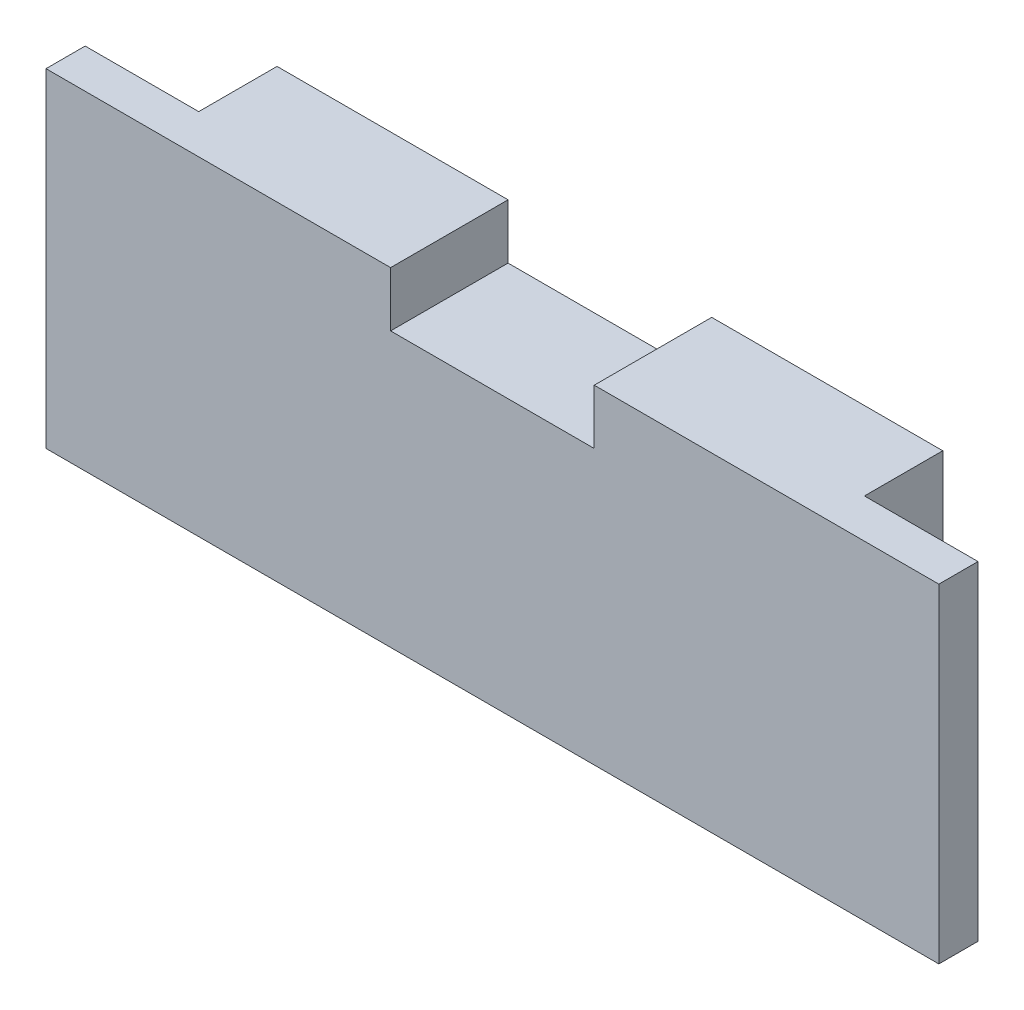
ISO-10303-21;
HEADER;
FILE_DESCRIPTION(('STEP AP214'),'2;1');
FILE_NAME('part.step','',(''),(''),'','','');
FILE_SCHEMA(('AUTOMOTIVE_DESIGN { 1 0 10303 214 1 1 1 1 }'));
ENDSEC;
DATA;
#1=APPLICATION_CONTEXT('core data for automotive mechanical design processes');
#2=APPLICATION_PROTOCOL_DEFINITION('international standard','automotive_design',2000,#1);
#3=PRODUCT_CONTEXT('',#1,'mechanical');
#4=PRODUCT('Part','Part','',(#3));
#5=PRODUCT_RELATED_PRODUCT_CATEGORY('part','',(#4));
#6=PRODUCT_DEFINITION_FORMATION('','',#4);
#7=PRODUCT_DEFINITION_CONTEXT('part definition',#1,'design');
#8=PRODUCT_DEFINITION('design','',#6,#7);
#9=PRODUCT_DEFINITION_SHAPE('','',#8);
#10=(LENGTH_UNIT() NAMED_UNIT(*) SI_UNIT(.MILLI.,.METRE.));
#11=(NAMED_UNIT(*) PLANE_ANGLE_UNIT() SI_UNIT($,.RADIAN.));
#12=(NAMED_UNIT(*) SI_UNIT($,.STERADIAN.) SOLID_ANGLE_UNIT());
#13=UNCERTAINTY_MEASURE_WITH_UNIT(LENGTH_MEASURE(1.E-05),#10,'distance_accuracy_value','');
#14=(GEOMETRIC_REPRESENTATION_CONTEXT(3) GLOBAL_UNCERTAINTY_ASSIGNED_CONTEXT((#13)) GLOBAL_UNIT_ASSIGNED_CONTEXT((#10,
#11,#12)) REPRESENTATION_CONTEXT('',''));
#15=CARTESIAN_POINT('',(0.,0.,0.));
#16=DIRECTION('',(0.,0.,1.));
#17=DIRECTION('',(1.,0.,0.));
#18=AXIS2_PLACEMENT_3D('',#15,#16,#17);
#19=CARTESIAN_POINT('',(-28.5,10.5,2.5));
#20=DIRECTION('',(0.,-1.,0.));
#21=DIRECTION('',(0.,0.,-1.));
#22=AXIS2_PLACEMENT_3D('',#19,#20,#21);
#23=PLANE('',#22);
#24=DIRECTION('',(1.,0.,0.));
#25=VECTOR('',#24,1.);
#26=CARTESIAN_POINT('',(21.25,10.5,-5.));
#27=LINE('',#26,#25);
#28=CARTESIAN_POINT('',(6.5,10.5,-5.));
#29=VERTEX_POINT('',#28);
#30=CARTESIAN_POINT('',(21.25,10.5,-5.));
#31=VERTEX_POINT('',#30);
#32=EDGE_CURVE('E135',#29,#31,#27,.T.);
#33=ORIENTED_EDGE('',*,*,#32,.F.);
#34=DIRECTION('',(0.,0.,1.));
#35=VECTOR('',#34,1.);
#36=CARTESIAN_POINT('',(6.5,10.5,-5.));
#37=LINE('',#36,#35);
#38=CARTESIAN_POINT('',(6.5,10.5,2.5));
#39=VERTEX_POINT('',#38);
#40=EDGE_CURVE('E122',#29,#39,#37,.T.);
#41=ORIENTED_EDGE('',*,*,#40,.T.);
#42=DIRECTION('',(-1.,0.,0.));
#43=VECTOR('',#42,1.);
#44=CARTESIAN_POINT('',(-28.5,10.5,2.5));
#45=LINE('',#44,#43);
#46=CARTESIAN_POINT('',(28.5,10.5,2.5));
#47=VERTEX_POINT('',#46);
#48=EDGE_CURVE('E178',#47,#39,#45,.T.);
#49=ORIENTED_EDGE('',*,*,#48,.F.);
#50=DIRECTION('',(0.,0.,-1.));
#51=VECTOR('',#50,1.);
#52=CARTESIAN_POINT('',(28.5,10.5,2.5));
#53=LINE('',#52,#51);
#54=CARTESIAN_POINT('',(28.5,10.5,0.));
#55=VERTEX_POINT('',#54);
#56=EDGE_CURVE('E11',#47,#55,#53,.T.);
#57=ORIENTED_EDGE('',*,*,#56,.T.);
#58=DIRECTION('',(-1.,0.,0.));
#59=VECTOR('',#58,1.);
#60=CARTESIAN_POINT('',(-28.5,10.5,0.));
#61=LINE('',#60,#59);
#62=CARTESIAN_POINT('',(21.25,10.5,0.));
#63=VERTEX_POINT('',#62);
#64=EDGE_CURVE('E187',#55,#63,#61,.T.);
#65=ORIENTED_EDGE('',*,*,#64,.T.);
#66=DIRECTION('',(0.,0.,1.));
#67=VECTOR('',#66,1.);
#68=CARTESIAN_POINT('',(21.25,10.5,-5.));
#69=LINE('',#68,#67);
#70=EDGE_CURVE('E143',#31,#63,#69,.T.);
#71=ORIENTED_EDGE('',*,*,#70,.F.);
#72=EDGE_LOOP('',(#33,#41,#49,#57,#65,#71));
#73=FACE_BOUND('',#72,.T.);
#74=ADVANCED_FACE('F33',(#73),#23,.F.);
#75=CARTESIAN_POINT('',(0.,0.,0.));
#76=DIRECTION('',(0.,0.,-1.));
#77=DIRECTION('',(-1.,0.,0.));
#78=AXIS2_PLACEMENT_3D('',#75,#76,#77);
#79=PLANE('',#78);
#80=DIRECTION('',(0.,1.,0.));
#81=VECTOR('',#80,1.);
#82=CARTESIAN_POINT('',(-21.25,-10.5,0.));
#83=LINE('',#82,#81);
#84=CARTESIAN_POINT('',(-21.25,-10.5,0.));
#85=VERTEX_POINT('',#84);
#86=CARTESIAN_POINT('',(-21.25,10.5,0.));
#87=VERTEX_POINT('',#86);
#88=EDGE_CURVE('E158',#85,#87,#83,.T.);
#89=ORIENTED_EDGE('',*,*,#88,.F.);
#90=DIRECTION('',(1.,0.,0.));
#91=VECTOR('',#90,1.);
#92=CARTESIAN_POINT('',(-28.5,-10.5,0.));
#93=LINE('',#92,#91);
#94=CARTESIAN_POINT('',(-28.5,-10.5,0.));
#95=VERTEX_POINT('',#94);
#96=EDGE_CURVE('E177',#95,#85,#93,.T.);
#97=ORIENTED_EDGE('',*,*,#96,.F.);
#98=DIRECTION('',(0.,-1.,0.));
#99=VECTOR('',#98,1.);
#100=CARTESIAN_POINT('',(-28.5,-10.5,0.));
#101=LINE('',#100,#99);
#102=CARTESIAN_POINT('',(-28.5,10.5,0.));
#103=VERTEX_POINT('',#102);
#104=EDGE_CURVE('E189',#103,#95,#101,.T.);
#105=ORIENTED_EDGE('',*,*,#104,.F.);
#106=EDGE_CURVE('E56',#87,#103,#61,.T.);
#107=ORIENTED_EDGE('',*,*,#106,.F.);
#108=EDGE_LOOP('',(#89,#97,#105,#107));
#109=FACE_BOUND('',#108,.T.);
#110=ADVANCED_FACE('F207',(#109),#79,.T.);
#111=CARTESIAN_POINT('',(28.5,-10.5,2.5));
#112=DIRECTION('',(-1.,0.,0.));
#113=DIRECTION('',(0.,0.,1.));
#114=AXIS2_PLACEMENT_3D('',#111,#112,#113);
#115=PLANE('',#114);
#116=DIRECTION('',(0.,1.,0.));
#117=VECTOR('',#116,1.);
#118=CARTESIAN_POINT('',(28.5,-10.5,0.));
#119=LINE('',#118,#117);
#120=CARTESIAN_POINT('',(28.5,-10.5,0.));
#121=VERTEX_POINT('',#120);
#122=EDGE_CURVE('E172',#121,#55,#119,.T.);
#123=ORIENTED_EDGE('',*,*,#122,.T.);
#124=ORIENTED_EDGE('',*,*,#56,.F.);
#125=DIRECTION('',(0.,1.,0.));
#126=VECTOR('',#125,1.);
#127=CARTESIAN_POINT('',(28.5,-10.5,2.5));
#128=LINE('',#127,#126);
#129=CARTESIAN_POINT('',(28.5,-10.5,2.5));
#130=VERTEX_POINT('',#129);
#131=EDGE_CURVE('E173',#130,#47,#128,.T.);
#132=ORIENTED_EDGE('',*,*,#131,.F.);
#133=DIRECTION('',(0.,0.,-1.));
#134=VECTOR('',#133,1.);
#135=CARTESIAN_POINT('',(28.5,-10.5,2.5));
#136=LINE('',#135,#134);
#137=EDGE_CURVE('E184',#130,#121,#136,.T.);
#138=ORIENTED_EDGE('',*,*,#137,.T.);
#139=EDGE_LOOP('',(#123,#124,#132,#138));
#140=FACE_BOUND('',#139,.T.);
#141=ADVANCED_FACE('F35',(#140),#115,.F.);
#142=CARTESIAN_POINT('',(-6.5,10.5,2.5));
#143=VERTEX_POINT('',#142);
#144=CARTESIAN_POINT('',(-28.5,10.5,2.5));
#145=VERTEX_POINT('',#144);
#146=EDGE_CURVE('E176',#143,#145,#45,.T.);
#147=ORIENTED_EDGE('',*,*,#146,.F.);
#148=DIRECTION('',(0.,0.,1.));
#149=VECTOR('',#148,1.);
#150=CARTESIAN_POINT('',(-6.5,10.5,-5.));
#151=LINE('',#150,#149);
#152=CARTESIAN_POINT('',(-6.5,10.5,-5.));
#153=VERTEX_POINT('',#152);
#154=EDGE_CURVE('E131',#153,#143,#151,.T.);
#155=ORIENTED_EDGE('',*,*,#154,.F.);
#156=CARTESIAN_POINT('',(-21.25,10.5,-5.));
#157=VERTEX_POINT('',#156);
#158=EDGE_CURVE('E145',#157,#153,#27,.T.);
#159=ORIENTED_EDGE('',*,*,#158,.F.);
#160=DIRECTION('',(0.,0.,1.));
#161=VECTOR('',#160,1.);
#162=CARTESIAN_POINT('',(-21.25,10.5,-5.));
#163=LINE('',#162,#161);
#164=EDGE_CURVE('E170',#157,#87,#163,.T.);
#165=ORIENTED_EDGE('',*,*,#164,.T.);
#166=ORIENTED_EDGE('',*,*,#106,.T.);
#167=DIRECTION('',(0.,0.,-1.));
#168=VECTOR('',#167,1.);
#169=CARTESIAN_POINT('',(-28.5,10.5,2.5));
#170=LINE('',#169,#168);
#171=EDGE_CURVE('E41',#145,#103,#170,.T.);
#172=ORIENTED_EDGE('',*,*,#171,.F.);
#173=EDGE_LOOP('',(#147,#155,#159,#165,#166,#172));
#174=FACE_BOUND('',#173,.T.);
#175=ADVANCED_FACE('F234',(#174),#23,.F.);
#176=CARTESIAN_POINT('',(-28.5,-10.5,2.5));
#177=DIRECTION('',(1.,0.,0.));
#178=DIRECTION('',(0.,0.,-1.));
#179=AXIS2_PLACEMENT_3D('',#176,#177,#178);
#180=PLANE('',#179);
#181=ORIENTED_EDGE('',*,*,#104,.T.);
#182=DIRECTION('',(0.,0.,-1.));
#183=VECTOR('',#182,1.);
#184=CARTESIAN_POINT('',(-28.5,-10.5,2.5));
#185=LINE('',#184,#183);
#186=CARTESIAN_POINT('',(-28.5,-10.5,2.5));
#187=VERTEX_POINT('',#186);
#188=EDGE_CURVE('E196',#187,#95,#185,.T.);
#189=ORIENTED_EDGE('',*,*,#188,.F.);
#190=DIRECTION('',(0.,-1.,0.));
#191=VECTOR('',#190,1.);
#192=CARTESIAN_POINT('',(-28.5,-10.5,2.5));
#193=LINE('',#192,#191);
#194=EDGE_CURVE('E180',#145,#187,#193,.T.);
#195=ORIENTED_EDGE('',*,*,#194,.F.);
#196=ORIENTED_EDGE('',*,*,#171,.T.);
#197=EDGE_LOOP('',(#181,#189,#195,#196));
#198=FACE_BOUND('',#197,.T.);
#199=ADVANCED_FACE('F202',(#198),#180,.F.);
#200=CARTESIAN_POINT('',(-28.5,-10.5,2.5));
#201=DIRECTION('',(0.,1.,0.));
#202=DIRECTION('',(0.,0.,1.));
#203=AXIS2_PLACEMENT_3D('',#200,#201,#202);
#204=PLANE('',#203);
#205=ORIENTED_EDGE('',*,*,#96,.T.);
#206=DIRECTION('',(0.,0.,1.));
#207=VECTOR('',#206,1.);
#208=CARTESIAN_POINT('',(-21.25,-10.5,-5.));
#209=LINE('',#208,#207);
#210=CARTESIAN_POINT('',(-21.25,-10.5,-5.));
#211=VERTEX_POINT('',#210);
#212=EDGE_CURVE('E157',#211,#85,#209,.T.);
#213=ORIENTED_EDGE('',*,*,#212,.F.);
#214=DIRECTION('',(-1.,0.,0.));
#215=VECTOR('',#214,1.);
#216=CARTESIAN_POINT('',(21.25,-10.5,-5.));
#217=LINE('',#216,#215);
#218=CARTESIAN_POINT('',(21.25,-10.5,-5.));
#219=VERTEX_POINT('',#218);
#220=EDGE_CURVE('E155',#219,#211,#217,.T.);
#221=ORIENTED_EDGE('',*,*,#220,.F.);
#222=DIRECTION('',(0.,0.,1.));
#223=VECTOR('',#222,1.);
#224=CARTESIAN_POINT('',(21.25,-10.5,-5.));
#225=LINE('',#224,#223);
#226=CARTESIAN_POINT('',(21.25,-10.5,0.));
#227=VERTEX_POINT('',#226);
#228=EDGE_CURVE('E166',#219,#227,#225,.T.);
#229=ORIENTED_EDGE('',*,*,#228,.T.);
#230=EDGE_CURVE('E191',#227,#121,#93,.T.);
#231=ORIENTED_EDGE('',*,*,#230,.T.);
#232=ORIENTED_EDGE('',*,*,#137,.F.);
#233=DIRECTION('',(1.,0.,0.));
#234=VECTOR('',#233,1.);
#235=CARTESIAN_POINT('',(-28.5,-10.5,2.5));
#236=LINE('',#235,#234);
#237=EDGE_CURVE('E182',#187,#130,#236,.T.);
#238=ORIENTED_EDGE('',*,*,#237,.F.);
#239=ORIENTED_EDGE('',*,*,#188,.T.);
#240=EDGE_LOOP('',(#205,#213,#221,#229,#231,#232,#238,#239));
#241=FACE_BOUND('',#240,.T.);
#242=ADVANCED_FACE('F210',(#241),#204,.F.);
#243=CARTESIAN_POINT('',(0.,0.,2.5));
#244=DIRECTION('',(0.,0.,-1.));
#245=DIRECTION('',(-1.,0.,0.));
#246=AXIS2_PLACEMENT_3D('',#243,#244,#245);
#247=PLANE('',#246);
#248=ORIENTED_EDGE('',*,*,#48,.T.);
#249=DIRECTION('',(0.,1.,0.));
#250=VECTOR('',#249,1.);
#251=CARTESIAN_POINT('',(6.5,7.00000000000001,2.5));
#252=LINE('',#251,#250);
#253=CARTESIAN_POINT('',(6.5,7.00000000000001,2.5));
#254=VERTEX_POINT('',#253);
#255=EDGE_CURVE('E127',#254,#39,#252,.T.);
#256=ORIENTED_EDGE('',*,*,#255,.F.);
#257=DIRECTION('',(1.,0.,0.));
#258=VECTOR('',#257,1.);
#259=CARTESIAN_POINT('',(-6.5,7.00000000000001,2.5));
#260=LINE('',#259,#258);
#261=CARTESIAN_POINT('',(-6.5,7.00000000000001,2.5));
#262=VERTEX_POINT('',#261);
#263=EDGE_CURVE('E139',#262,#254,#260,.T.);
#264=ORIENTED_EDGE('',*,*,#263,.F.);
#265=DIRECTION('',(0.,-1.,0.));
#266=VECTOR('',#265,1.);
#267=CARTESIAN_POINT('',(-6.5,7.00000000000001,2.5));
#268=LINE('',#267,#266);
#269=EDGE_CURVE('E232',#143,#262,#268,.T.);
#270=ORIENTED_EDGE('',*,*,#269,.F.);
#271=ORIENTED_EDGE('',*,*,#146,.T.);
#272=ORIENTED_EDGE('',*,*,#194,.T.);
#273=ORIENTED_EDGE('',*,*,#237,.T.);
#274=ORIENTED_EDGE('',*,*,#131,.T.);
#275=EDGE_LOOP('',(#248,#256,#264,#270,#271,#272,#273,#274));
#276=FACE_BOUND('',#275,.T.);
#277=ADVANCED_FACE('F228',(#276),#247,.F.);
#278=DIRECTION('',(0.,-1.,0.));
#279=VECTOR('',#278,1.);
#280=CARTESIAN_POINT('',(21.25,-10.5,0.));
#281=LINE('',#280,#279);
#282=EDGE_CURVE('E151',#63,#227,#281,.T.);
#283=ORIENTED_EDGE('',*,*,#282,.F.);
#284=ORIENTED_EDGE('',*,*,#64,.F.);
#285=ORIENTED_EDGE('',*,*,#122,.F.);
#286=ORIENTED_EDGE('',*,*,#230,.F.);
#287=EDGE_LOOP('',(#283,#284,#285,#286));
#288=FACE_BOUND('',#287,.T.);
#289=ADVANCED_FACE('F222',(#288),#79,.T.);
#290=CARTESIAN_POINT('',(-21.25,-10.5,-5.));
#291=DIRECTION('',(1.,0.,0.));
#292=DIRECTION('',(0.,0.,-1.));
#293=AXIS2_PLACEMENT_3D('',#290,#291,#292);
#294=PLANE('',#293);
#295=ORIENTED_EDGE('',*,*,#88,.T.);
#296=ORIENTED_EDGE('',*,*,#164,.F.);
#297=DIRECTION('',(0.,1.,0.));
#298=VECTOR('',#297,1.);
#299=CARTESIAN_POINT('',(-21.25,-10.5,-5.));
#300=LINE('',#299,#298);
#301=EDGE_CURVE('E146',#211,#157,#300,.T.);
#302=ORIENTED_EDGE('',*,*,#301,.F.);
#303=ORIENTED_EDGE('',*,*,#212,.T.);
#304=EDGE_LOOP('',(#295,#296,#302,#303));
#305=FACE_BOUND('',#304,.T.);
#306=ADVANCED_FACE('F215',(#305),#294,.F.);
#307=CARTESIAN_POINT('',(21.25,-10.5,-5.));
#308=DIRECTION('',(-1.,0.,0.));
#309=DIRECTION('',(0.,0.,1.));
#310=AXIS2_PLACEMENT_3D('',#307,#308,#309);
#311=PLANE('',#310);
#312=ORIENTED_EDGE('',*,*,#282,.T.);
#313=ORIENTED_EDGE('',*,*,#228,.F.);
#314=DIRECTION('',(0.,-1.,0.));
#315=VECTOR('',#314,1.);
#316=CARTESIAN_POINT('',(21.25,-10.5,-5.));
#317=LINE('',#316,#315);
#318=EDGE_CURVE('E149',#31,#219,#317,.T.);
#319=ORIENTED_EDGE('',*,*,#318,.F.);
#320=ORIENTED_EDGE('',*,*,#70,.T.);
#321=EDGE_LOOP('',(#312,#313,#319,#320));
#322=FACE_BOUND('',#321,.T.);
#323=ADVANCED_FACE('F220',(#322),#311,.F.);
#324=CARTESIAN_POINT('',(0.,0.,-5.));
#325=DIRECTION('',(0.,0.,1.));
#326=DIRECTION('',(1.,0.,0.));
#327=AXIS2_PLACEMENT_3D('',#324,#325,#326);
#328=PLANE('',#327);
#329=DIRECTION('',(1.,0.,0.));
#330=VECTOR('',#329,1.);
#331=CARTESIAN_POINT('',(-6.5,7.00000000000001,-5.));
#332=LINE('',#331,#330);
#333=CARTESIAN_POINT('',(-6.5,7.00000000000001,-5.));
#334=VERTEX_POINT('',#333);
#335=CARTESIAN_POINT('',(6.5,7.00000000000001,-5.));
#336=VERTEX_POINT('',#335);
#337=EDGE_CURVE('E48',#334,#336,#332,.T.);
#338=ORIENTED_EDGE('',*,*,#337,.T.);
#339=DIRECTION('',(0.,1.,0.));
#340=VECTOR('',#339,1.);
#341=CARTESIAN_POINT('',(6.5,7.00000000000001,-5.));
#342=LINE('',#341,#340);
#343=EDGE_CURVE('E125',#336,#29,#342,.T.);
#344=ORIENTED_EDGE('',*,*,#343,.T.);
#345=ORIENTED_EDGE('',*,*,#32,.T.);
#346=ORIENTED_EDGE('',*,*,#318,.T.);
#347=ORIENTED_EDGE('',*,*,#220,.T.);
#348=ORIENTED_EDGE('',*,*,#301,.T.);
#349=ORIENTED_EDGE('',*,*,#158,.T.);
#350=DIRECTION('',(0.,-1.,0.));
#351=VECTOR('',#350,1.);
#352=CARTESIAN_POINT('',(-6.5,7.00000000000001,-5.));
#353=LINE('',#352,#351);
#354=EDGE_CURVE('E138',#153,#334,#353,.T.);
#355=ORIENTED_EDGE('',*,*,#354,.T.);
#356=EDGE_LOOP('',(#338,#344,#345,#346,#347,#348,#349,#355));
#357=FACE_BOUND('',#356,.T.);
#358=ADVANCED_FACE('F134',(#357),#328,.F.);
#359=CARTESIAN_POINT('',(6.5,7.00000000000001,-5.));
#360=DIRECTION('',(1.,0.,0.));
#361=DIRECTION('',(0.,0.,-1.));
#362=AXIS2_PLACEMENT_3D('',#359,#360,#361);
#363=PLANE('',#362);
#364=ORIENTED_EDGE('',*,*,#255,.T.);
#365=ORIENTED_EDGE('',*,*,#40,.F.);
#366=ORIENTED_EDGE('',*,*,#343,.F.);
#367=DIRECTION('',(0.,0.,1.));
#368=VECTOR('',#367,1.);
#369=CARTESIAN_POINT('',(6.5,7.00000000000001,-5.));
#370=LINE('',#369,#368);
#371=EDGE_CURVE('E161',#336,#254,#370,.T.);
#372=ORIENTED_EDGE('',*,*,#371,.T.);
#373=EDGE_LOOP('',(#364,#365,#366,#372));
#374=FACE_BOUND('',#373,.T.);
#375=ADVANCED_FACE('F124',(#374),#363,.F.);
#376=CARTESIAN_POINT('',(-6.5,7.00000000000001,-5.));
#377=DIRECTION('',(0.,-1.,0.));
#378=DIRECTION('',(0.,0.,-1.));
#379=AXIS2_PLACEMENT_3D('',#376,#377,#378);
#380=PLANE('',#379);
#381=ORIENTED_EDGE('',*,*,#263,.T.);
#382=ORIENTED_EDGE('',*,*,#371,.F.);
#383=ORIENTED_EDGE('',*,*,#337,.F.);
#384=DIRECTION('',(0.,0.,1.));
#385=VECTOR('',#384,1.);
#386=CARTESIAN_POINT('',(-6.5,7.00000000000001,-5.));
#387=LINE('',#386,#385);
#388=EDGE_CURVE('E236',#334,#262,#387,.T.);
#389=ORIENTED_EDGE('',*,*,#388,.T.);
#390=EDGE_LOOP('',(#381,#382,#383,#389));
#391=FACE_BOUND('',#390,.T.);
#392=ADVANCED_FACE('F247',(#391),#380,.F.);
#393=CARTESIAN_POINT('',(-6.5,7.00000000000001,-5.));
#394=DIRECTION('',(-1.,0.,0.));
#395=DIRECTION('',(0.,0.,1.));
#396=AXIS2_PLACEMENT_3D('',#393,#394,#395);
#397=PLANE('',#396);
#398=ORIENTED_EDGE('',*,*,#269,.T.);
#399=ORIENTED_EDGE('',*,*,#388,.F.);
#400=ORIENTED_EDGE('',*,*,#354,.F.);
#401=ORIENTED_EDGE('',*,*,#154,.T.);
#402=EDGE_LOOP('',(#398,#399,#400,#401));
#403=FACE_BOUND('',#402,.T.);
#404=ADVANCED_FACE('F246',(#403),#397,.F.);
#405=CLOSED_SHELL('',(#74,#110,#141,#175,#199,#242,#277,#289,#306,#323,#358,#375,#392,#404));
#406=MANIFOLD_SOLID_BREP('B2',#405);
#407=ADVANCED_BREP_SHAPE_REPRESENTATION('',(#18,#406),#14);
#408=SHAPE_DEFINITION_REPRESENTATION(#9,#407);
ENDSEC;
END-ISO-10303-21;
